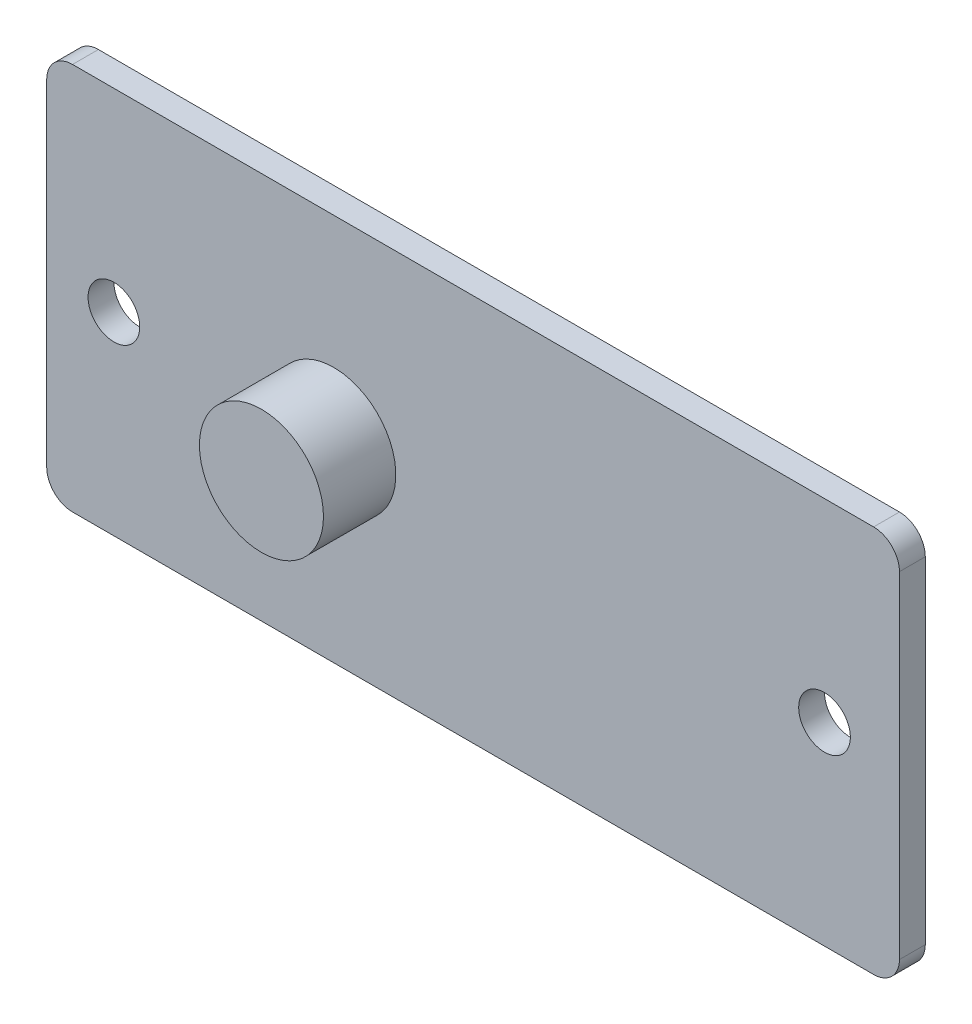
ISO-10303-21;
HEADER;
FILE_DESCRIPTION(('STEP AP214'),'2;1');
FILE_NAME('part.step','',(''),(''),'','','');
FILE_SCHEMA(('AUTOMOTIVE_DESIGN { 1 0 10303 214 1 1 1 1 }'));
ENDSEC;
DATA;
#1=APPLICATION_CONTEXT('core data for automotive mechanical design processes');
#2=APPLICATION_PROTOCOL_DEFINITION('international standard','automotive_design',2000,#1);
#3=PRODUCT_CONTEXT('',#1,'mechanical');
#4=PRODUCT('Part','Part','',(#3));
#5=PRODUCT_RELATED_PRODUCT_CATEGORY('part','',(#4));
#6=PRODUCT_DEFINITION_FORMATION('','',#4);
#7=PRODUCT_DEFINITION_CONTEXT('part definition',#1,'design');
#8=PRODUCT_DEFINITION('design','',#6,#7);
#9=PRODUCT_DEFINITION_SHAPE('','',#8);
#10=(LENGTH_UNIT() NAMED_UNIT(*) SI_UNIT(.MILLI.,.METRE.));
#11=(NAMED_UNIT(*) PLANE_ANGLE_UNIT() SI_UNIT($,.RADIAN.));
#12=(NAMED_UNIT(*) SI_UNIT($,.STERADIAN.) SOLID_ANGLE_UNIT());
#13=UNCERTAINTY_MEASURE_WITH_UNIT(LENGTH_MEASURE(1.E-05),#10,'distance_accuracy_value','');
#14=(GEOMETRIC_REPRESENTATION_CONTEXT(3) GLOBAL_UNCERTAINTY_ASSIGNED_CONTEXT((#13)) GLOBAL_UNIT_ASSIGNED_CONTEXT((#10,
#11,#12)) REPRESENTATION_CONTEXT('',''));
#15=CARTESIAN_POINT('',(0.,0.,0.));
#16=DIRECTION('',(0.,0.,1.));
#17=DIRECTION('',(1.,0.,0.));
#18=AXIS2_PLACEMENT_3D('',#15,#16,#17);
#19=CARTESIAN_POINT('',(15.5,6.5,1.));
#20=DIRECTION('',(0.,0.,-1.));
#21=DIRECTION('',(-1.,0.,0.));
#22=AXIS2_PLACEMENT_3D('',#19,#20,#21);
#23=PLANE('',#22);
#24=CARTESIAN_POINT('',(-5.39,0.,1.));
#25=DIRECTION('',(0.,0.,-1.));
#26=DIRECTION('',(-1.,0.,0.));
#27=AXIS2_PLACEMENT_3D('',#24,#25,#26);
#28=CIRCLE('',#27,2.4);
#29=CARTESIAN_POINT('',(-7.79,0.,1.));
#30=VERTEX_POINT('',#29);
#31=EDGE_CURVE('E11',#30,#30,#28,.F.);
#32=ORIENTED_EDGE('',*,*,#31,.F.);
#33=EDGE_LOOP('',(#32));
#34=FACE_BOUND('',#33,.T.);
#35=CARTESIAN_POINT('',(15.5,6.5,1.));
#36=DIRECTION('',(0.,0.,1.));
#37=DIRECTION('',(-1.,0.,0.));
#38=AXIS2_PLACEMENT_3D('',#35,#36,#37);
#39=CIRCLE('',#38,1.);
#40=CARTESIAN_POINT('',(16.5,6.49999999999999,1.));
#41=VERTEX_POINT('',#40);
#42=CARTESIAN_POINT('',(15.5,7.5,1.));
#43=VERTEX_POINT('',#42);
#44=EDGE_CURVE('E145',#41,#43,#39,.T.);
#45=ORIENTED_EDGE('',*,*,#44,.T.);
#46=DIRECTION('',(-1.,0.,0.));
#47=VECTOR('',#46,1.);
#48=CARTESIAN_POINT('',(-15.5,7.5,1.));
#49=LINE('',#48,#47);
#50=CARTESIAN_POINT('',(-15.5,7.5,1.));
#51=VERTEX_POINT('',#50);
#52=EDGE_CURVE('E93',#43,#51,#49,.T.);
#53=ORIENTED_EDGE('',*,*,#52,.T.);
#54=CARTESIAN_POINT('',(-15.5,6.5,1.));
#55=DIRECTION('',(0.,0.,1.));
#56=DIRECTION('',(1.,0.,0.));
#57=AXIS2_PLACEMENT_3D('',#54,#55,#56);
#58=CIRCLE('',#57,1.);
#59=CARTESIAN_POINT('',(-16.5,6.49999999999999,1.));
#60=VERTEX_POINT('',#59);
#61=EDGE_CURVE('E177',#51,#60,#58,.T.);
#62=ORIENTED_EDGE('',*,*,#61,.T.);
#63=DIRECTION('',(0.,-1.,0.));
#64=VECTOR('',#63,1.);
#65=CARTESIAN_POINT('',(-16.5,6.49999999999999,1.));
#66=LINE('',#65,#64);
#67=CARTESIAN_POINT('',(-16.5,-6.49999999999999,1.));
#68=VERTEX_POINT('',#67);
#69=EDGE_CURVE('E176',#60,#68,#66,.T.);
#70=ORIENTED_EDGE('',*,*,#69,.T.);
#71=CARTESIAN_POINT('',(-15.5,-6.5,1.));
#72=DIRECTION('',(0.,0.,1.));
#73=DIRECTION('',(1.,0.,0.));
#74=AXIS2_PLACEMENT_3D('',#71,#72,#73);
#75=CIRCLE('',#74,1.);
#76=CARTESIAN_POINT('',(-15.5,-7.5,1.));
#77=VERTEX_POINT('',#76);
#78=EDGE_CURVE('E112',#68,#77,#75,.T.);
#79=ORIENTED_EDGE('',*,*,#78,.T.);
#80=DIRECTION('',(1.,0.,0.));
#81=VECTOR('',#80,1.);
#82=CARTESIAN_POINT('',(-15.5,-7.5,1.));
#83=LINE('',#82,#81);
#84=CARTESIAN_POINT('',(15.5,-7.5,1.));
#85=VERTEX_POINT('',#84);
#86=EDGE_CURVE('E106',#77,#85,#83,.T.);
#87=ORIENTED_EDGE('',*,*,#86,.T.);
#88=CARTESIAN_POINT('',(15.5,-6.5,1.));
#89=DIRECTION('',(0.,0.,1.));
#90=DIRECTION('',(1.,0.,0.));
#91=AXIS2_PLACEMENT_3D('',#88,#89,#90);
#92=CIRCLE('',#91,1.);
#93=CARTESIAN_POINT('',(16.5,-6.5,1.));
#94=VERTEX_POINT('',#93);
#95=EDGE_CURVE('E110',#85,#94,#92,.T.);
#96=ORIENTED_EDGE('',*,*,#95,.T.);
#97=DIRECTION('',(0.,1.,0.));
#98=VECTOR('',#97,1.);
#99=CARTESIAN_POINT('',(16.5,6.49999999999999,1.));
#100=LINE('',#99,#98);
#101=EDGE_CURVE('E49',#94,#41,#100,.T.);
#102=ORIENTED_EDGE('',*,*,#101,.T.);
#103=EDGE_LOOP('',(#45,#53,#62,#70,#79,#87,#96,#102));
#104=FACE_BOUND('',#103,.T.);
#105=CARTESIAN_POINT('',(-13.9,0.,1.));
#106=DIRECTION('',(0.,0.,1.));
#107=DIRECTION('',(1.,0.,0.));
#108=AXIS2_PLACEMENT_3D('',#105,#106,#107);
#109=CIRCLE('',#108,1.);
#110=CARTESIAN_POINT('',(-12.9,0.,1.));
#111=VERTEX_POINT('',#110);
#112=EDGE_CURVE('E134',#111,#111,#109,.T.);
#113=ORIENTED_EDGE('',*,*,#112,.F.);
#114=EDGE_LOOP('',(#113));
#115=FACE_BOUND('',#114,.T.);
#116=CARTESIAN_POINT('',(13.6,0.,1.));
#117=DIRECTION('',(0.,0.,1.));
#118=DIRECTION('',(-1.,0.,0.));
#119=AXIS2_PLACEMENT_3D('',#116,#117,#118);
#120=CIRCLE('',#119,1.);
#121=CARTESIAN_POINT('',(12.6,0.,1.));
#122=VERTEX_POINT('',#121);
#123=EDGE_CURVE('E186',#122,#122,#120,.T.);
#124=ORIENTED_EDGE('',*,*,#123,.F.);
#125=EDGE_LOOP('',(#124));
#126=FACE_BOUND('',#125,.T.);
#127=ADVANCED_FACE('F32',(#34,#104,#115,#126),#23,.F.);
#128=CARTESIAN_POINT('',(15.5,6.5,0.));
#129=DIRECTION('',(0.,0.,-1.));
#130=DIRECTION('',(-1.,0.,0.));
#131=AXIS2_PLACEMENT_3D('',#128,#129,#130);
#132=PLANE('',#131);
#133=CARTESIAN_POINT('',(-13.9,0.,0.));
#134=DIRECTION('',(0.,0.,1.));
#135=DIRECTION('',(1.,0.,0.));
#136=AXIS2_PLACEMENT_3D('',#133,#134,#135);
#137=CIRCLE('',#136,1.);
#138=CARTESIAN_POINT('',(-12.9,0.,0.));
#139=VERTEX_POINT('',#138);
#140=EDGE_CURVE('E183',#139,#139,#137,.T.);
#141=ORIENTED_EDGE('',*,*,#140,.T.);
#142=EDGE_LOOP('',(#141));
#143=FACE_BOUND('',#142,.T.);
#144=CARTESIAN_POINT('',(15.5,6.5,0.));
#145=DIRECTION('',(0.,0.,1.));
#146=DIRECTION('',(-1.,0.,0.));
#147=AXIS2_PLACEMENT_3D('',#144,#145,#146);
#148=CIRCLE('',#147,1.);
#149=CARTESIAN_POINT('',(16.5,6.49999999999999,0.));
#150=VERTEX_POINT('',#149);
#151=CARTESIAN_POINT('',(15.5,7.5,0.));
#152=VERTEX_POINT('',#151);
#153=EDGE_CURVE('E130',#150,#152,#148,.T.);
#154=ORIENTED_EDGE('',*,*,#153,.F.);
#155=DIRECTION('',(0.,1.,0.));
#156=VECTOR('',#155,1.);
#157=CARTESIAN_POINT('',(16.5,6.49999999999999,0.));
#158=LINE('',#157,#156);
#159=CARTESIAN_POINT('',(16.5,-6.5,0.));
#160=VERTEX_POINT('',#159);
#161=EDGE_CURVE('E84',#160,#150,#158,.T.);
#162=ORIENTED_EDGE('',*,*,#161,.F.);
#163=CARTESIAN_POINT('',(15.5,-6.5,0.));
#164=DIRECTION('',(0.,0.,1.));
#165=DIRECTION('',(1.,0.,0.));
#166=AXIS2_PLACEMENT_3D('',#163,#164,#165);
#167=CIRCLE('',#166,1.);
#168=CARTESIAN_POINT('',(15.5,-7.5,0.));
#169=VERTEX_POINT('',#168);
#170=EDGE_CURVE('E78',#169,#160,#167,.T.);
#171=ORIENTED_EDGE('',*,*,#170,.F.);
#172=DIRECTION('',(1.,0.,0.));
#173=VECTOR('',#172,1.);
#174=CARTESIAN_POINT('',(-15.5,-7.5,0.));
#175=LINE('',#174,#173);
#176=CARTESIAN_POINT('',(-15.5,-7.5,0.));
#177=VERTEX_POINT('',#176);
#178=EDGE_CURVE('E120',#177,#169,#175,.T.);
#179=ORIENTED_EDGE('',*,*,#178,.F.);
#180=CARTESIAN_POINT('',(-15.5,-6.5,0.));
#181=DIRECTION('',(0.,0.,1.));
#182=DIRECTION('',(1.,0.,0.));
#183=AXIS2_PLACEMENT_3D('',#180,#181,#182);
#184=CIRCLE('',#183,1.);
#185=CARTESIAN_POINT('',(-16.5,-6.49999999999999,0.));
#186=VERTEX_POINT('',#185);
#187=EDGE_CURVE('E140',#186,#177,#184,.T.);
#188=ORIENTED_EDGE('',*,*,#187,.F.);
#189=DIRECTION('',(0.,-1.,0.));
#190=VECTOR('',#189,1.);
#191=CARTESIAN_POINT('',(-16.5,6.49999999999999,0.));
#192=LINE('',#191,#190);
#193=CARTESIAN_POINT('',(-16.5,6.49999999999999,0.));
#194=VERTEX_POINT('',#193);
#195=EDGE_CURVE('E138',#194,#186,#192,.T.);
#196=ORIENTED_EDGE('',*,*,#195,.F.);
#197=CARTESIAN_POINT('',(-15.5,6.5,0.));
#198=DIRECTION('',(0.,0.,1.));
#199=DIRECTION('',(1.,0.,0.));
#200=AXIS2_PLACEMENT_3D('',#197,#198,#199);
#201=CIRCLE('',#200,1.);
#202=CARTESIAN_POINT('',(-15.5,7.5,0.));
#203=VERTEX_POINT('',#202);
#204=EDGE_CURVE('E136',#203,#194,#201,.T.);
#205=ORIENTED_EDGE('',*,*,#204,.F.);
#206=DIRECTION('',(-1.,0.,0.));
#207=VECTOR('',#206,1.);
#208=CARTESIAN_POINT('',(-15.5,7.5,0.));
#209=LINE('',#208,#207);
#210=EDGE_CURVE('E133',#152,#203,#209,.T.);
#211=ORIENTED_EDGE('',*,*,#210,.F.);
#212=EDGE_LOOP('',(#154,#162,#171,#179,#188,#196,#205,#211));
#213=FACE_BOUND('',#212,.T.);
#214=CARTESIAN_POINT('',(13.6,0.,0.));
#215=DIRECTION('',(0.,0.,1.));
#216=DIRECTION('',(-1.,0.,0.));
#217=AXIS2_PLACEMENT_3D('',#214,#215,#216);
#218=CIRCLE('',#217,1.);
#219=CARTESIAN_POINT('',(12.6,0.,0.));
#220=VERTEX_POINT('',#219);
#221=EDGE_CURVE('E189',#220,#220,#218,.T.);
#222=ORIENTED_EDGE('',*,*,#221,.T.);
#223=EDGE_LOOP('',(#222));
#224=FACE_BOUND('',#223,.T.);
#225=ADVANCED_FACE('F163',(#143,#213,#224),#132,.T.);
#226=CARTESIAN_POINT('',(15.5,6.5,1.));
#227=DIRECTION('',(0.,0.,-1.));
#228=DIRECTION('',(-1.,0.,0.));
#229=AXIS2_PLACEMENT_3D('',#226,#227,#228);
#230=CYLINDRICAL_SURFACE('',#229,1.);
#231=ORIENTED_EDGE('',*,*,#153,.T.);
#232=DIRECTION('',(0.,0.,-1.));
#233=VECTOR('',#232,1.);
#234=CARTESIAN_POINT('',(15.5,7.5,1.));
#235=LINE('',#234,#233);
#236=EDGE_CURVE('E41',#43,#152,#235,.T.);
#237=ORIENTED_EDGE('',*,*,#236,.F.);
#238=ORIENTED_EDGE('',*,*,#44,.F.);
#239=DIRECTION('',(0.,0.,-1.));
#240=VECTOR('',#239,1.);
#241=CARTESIAN_POINT('',(16.5,6.49999999999999,1.));
#242=LINE('',#241,#240);
#243=EDGE_CURVE('E126',#41,#150,#242,.T.);
#244=ORIENTED_EDGE('',*,*,#243,.T.);
#245=EDGE_LOOP('',(#231,#237,#238,#244));
#246=FACE_BOUND('',#245,.T.);
#247=ADVANCED_FACE('F34',(#246),#230,.T.);
#248=CARTESIAN_POINT('',(-15.5,7.5,1.));
#249=DIRECTION('',(0.,-1.,0.));
#250=DIRECTION('',(0.,0.,-1.));
#251=AXIS2_PLACEMENT_3D('',#248,#249,#250);
#252=PLANE('',#251);
#253=ORIENTED_EDGE('',*,*,#210,.T.);
#254=DIRECTION('',(0.,0.,-1.));
#255=VECTOR('',#254,1.);
#256=CARTESIAN_POINT('',(-15.5,7.5,1.));
#257=LINE('',#256,#255);
#258=EDGE_CURVE('E155',#51,#203,#257,.T.);
#259=ORIENTED_EDGE('',*,*,#258,.F.);
#260=ORIENTED_EDGE('',*,*,#52,.F.);
#261=ORIENTED_EDGE('',*,*,#236,.T.);
#262=EDGE_LOOP('',(#253,#259,#260,#261));
#263=FACE_BOUND('',#262,.T.);
#264=ADVANCED_FACE('F158',(#263),#252,.F.);
#265=CARTESIAN_POINT('',(-15.5,6.5,1.));
#266=DIRECTION('',(0.,0.,-1.));
#267=DIRECTION('',(-1.,0.,0.));
#268=AXIS2_PLACEMENT_3D('',#265,#266,#267);
#269=CYLINDRICAL_SURFACE('',#268,1.);
#270=ORIENTED_EDGE('',*,*,#204,.T.);
#271=DIRECTION('',(0.,0.,-1.));
#272=VECTOR('',#271,1.);
#273=CARTESIAN_POINT('',(-16.5,6.49999999999999,1.));
#274=LINE('',#273,#272);
#275=EDGE_CURVE('E152',#60,#194,#274,.T.);
#276=ORIENTED_EDGE('',*,*,#275,.F.);
#277=ORIENTED_EDGE('',*,*,#61,.F.);
#278=ORIENTED_EDGE('',*,*,#258,.T.);
#279=EDGE_LOOP('',(#270,#276,#277,#278));
#280=FACE_BOUND('',#279,.T.);
#281=ADVANCED_FACE('F170',(#280),#269,.T.);
#282=CARTESIAN_POINT('',(-16.5,6.49999999999999,1.));
#283=DIRECTION('',(1.,0.,0.));
#284=DIRECTION('',(0.,1.,0.));
#285=AXIS2_PLACEMENT_3D('',#282,#283,#284);
#286=PLANE('',#285);
#287=ORIENTED_EDGE('',*,*,#195,.T.);
#288=DIRECTION('',(0.,0.,-1.));
#289=VECTOR('',#288,1.);
#290=CARTESIAN_POINT('',(-16.5,-6.49999999999999,1.));
#291=LINE('',#290,#289);
#292=EDGE_CURVE('E149',#68,#186,#291,.T.);
#293=ORIENTED_EDGE('',*,*,#292,.F.);
#294=ORIENTED_EDGE('',*,*,#69,.F.);
#295=ORIENTED_EDGE('',*,*,#275,.T.);
#296=EDGE_LOOP('',(#287,#293,#294,#295));
#297=FACE_BOUND('',#296,.T.);
#298=ADVANCED_FACE('F174',(#297),#286,.F.);
#299=CARTESIAN_POINT('',(-15.5,-6.5,1.));
#300=DIRECTION('',(0.,0.,-1.));
#301=DIRECTION('',(-1.,0.,0.));
#302=AXIS2_PLACEMENT_3D('',#299,#300,#301);
#303=CYLINDRICAL_SURFACE('',#302,1.);
#304=ORIENTED_EDGE('',*,*,#187,.T.);
#305=DIRECTION('',(0.,0.,-1.));
#306=VECTOR('',#305,1.);
#307=CARTESIAN_POINT('',(-15.5,-7.5,1.));
#308=LINE('',#307,#306);
#309=EDGE_CURVE('E121',#77,#177,#308,.T.);
#310=ORIENTED_EDGE('',*,*,#309,.F.);
#311=ORIENTED_EDGE('',*,*,#78,.F.);
#312=ORIENTED_EDGE('',*,*,#292,.T.);
#313=EDGE_LOOP('',(#304,#310,#311,#312));
#314=FACE_BOUND('',#313,.T.);
#315=ADVANCED_FACE('F225',(#314),#303,.T.);
#316=CARTESIAN_POINT('',(-15.5,-7.5,1.));
#317=DIRECTION('',(0.,1.,0.));
#318=DIRECTION('',(0.,0.,1.));
#319=AXIS2_PLACEMENT_3D('',#316,#317,#318);
#320=PLANE('',#319);
#321=ORIENTED_EDGE('',*,*,#178,.T.);
#322=DIRECTION('',(0.,0.,-1.));
#323=VECTOR('',#322,1.);
#324=CARTESIAN_POINT('',(15.5,-7.5,1.));
#325=LINE('',#324,#323);
#326=EDGE_CURVE('E117',#85,#169,#325,.T.);
#327=ORIENTED_EDGE('',*,*,#326,.F.);
#328=ORIENTED_EDGE('',*,*,#86,.F.);
#329=ORIENTED_EDGE('',*,*,#309,.T.);
#330=EDGE_LOOP('',(#321,#327,#328,#329));
#331=FACE_BOUND('',#330,.T.);
#332=ADVANCED_FACE('F118',(#331),#320,.F.);
#333=CARTESIAN_POINT('',(15.5,-6.5,1.));
#334=DIRECTION('',(0.,0.,-1.));
#335=DIRECTION('',(-1.,0.,0.));
#336=AXIS2_PLACEMENT_3D('',#333,#334,#335);
#337=CYLINDRICAL_SURFACE('',#336,1.);
#338=ORIENTED_EDGE('',*,*,#170,.T.);
#339=DIRECTION('',(0.,0.,-1.));
#340=VECTOR('',#339,1.);
#341=CARTESIAN_POINT('',(16.5,-6.5,1.));
#342=LINE('',#341,#340);
#343=EDGE_CURVE('E122',#94,#160,#342,.T.);
#344=ORIENTED_EDGE('',*,*,#343,.F.);
#345=ORIENTED_EDGE('',*,*,#95,.F.);
#346=ORIENTED_EDGE('',*,*,#326,.T.);
#347=EDGE_LOOP('',(#338,#344,#345,#346));
#348=FACE_BOUND('',#347,.T.);
#349=ADVANCED_FACE('F124',(#348),#337,.T.);
#350=CARTESIAN_POINT('',(16.5,6.49999999999999,1.));
#351=DIRECTION('',(-1.,0.,0.));
#352=DIRECTION('',(0.,-1.,0.));
#353=AXIS2_PLACEMENT_3D('',#350,#351,#352);
#354=PLANE('',#353);
#355=ORIENTED_EDGE('',*,*,#161,.T.);
#356=ORIENTED_EDGE('',*,*,#243,.F.);
#357=ORIENTED_EDGE('',*,*,#101,.F.);
#358=ORIENTED_EDGE('',*,*,#343,.T.);
#359=EDGE_LOOP('',(#355,#356,#357,#358));
#360=FACE_BOUND('',#359,.T.);
#361=ADVANCED_FACE('F218',(#360),#354,.F.);
#362=CARTESIAN_POINT('',(-13.9,0.,1.));
#363=DIRECTION('',(0.,0.,-1.));
#364=DIRECTION('',(-1.,0.,0.));
#365=AXIS2_PLACEMENT_3D('',#362,#363,#364);
#366=CYLINDRICAL_SURFACE('',#365,1.);
#367=ORIENTED_EDGE('',*,*,#112,.T.);
#368=EDGE_LOOP('',(#367));
#369=FACE_BOUND('',#368,.T.);
#370=ORIENTED_EDGE('',*,*,#140,.F.);
#371=EDGE_LOOP('',(#370));
#372=FACE_BOUND('',#371,.T.);
#373=ADVANCED_FACE('F215',(#369,#372),#366,.F.);
#374=CARTESIAN_POINT('',(13.6,0.,1.));
#375=DIRECTION('',(0.,0.,-1.));
#376=DIRECTION('',(-1.,0.,0.));
#377=AXIS2_PLACEMENT_3D('',#374,#375,#376);
#378=CYLINDRICAL_SURFACE('',#377,1.);
#379=ORIENTED_EDGE('',*,*,#123,.T.);
#380=EDGE_LOOP('',(#379));
#381=FACE_BOUND('',#380,.T.);
#382=ORIENTED_EDGE('',*,*,#221,.F.);
#383=EDGE_LOOP('',(#382));
#384=FACE_BOUND('',#383,.T.);
#385=ADVANCED_FACE('F203',(#381,#384),#378,.F.);
#386=CARTESIAN_POINT('',(-5.39,0.,3.8));
#387=DIRECTION('',(0.,0.,-1.));
#388=DIRECTION('',(-1.,0.,0.));
#389=AXIS2_PLACEMENT_3D('',#386,#387,#388);
#390=CYLINDRICAL_SURFACE('',#389,2.4);
#391=CARTESIAN_POINT('',(-5.39,0.,3.8));
#392=DIRECTION('',(0.,0.,1.));
#393=DIRECTION('',(1.,0.,0.));
#394=AXIS2_PLACEMENT_3D('',#391,#392,#393);
#395=CIRCLE('',#394,2.4);
#396=CARTESIAN_POINT('',(-2.99,0.,3.8));
#397=VERTEX_POINT('',#396);
#398=EDGE_CURVE('E192',#397,#397,#395,.T.);
#399=ORIENTED_EDGE('',*,*,#398,.F.);
#400=EDGE_LOOP('',(#399));
#401=FACE_BOUND('',#400,.T.);
#402=ORIENTED_EDGE('',*,*,#31,.T.);
#403=EDGE_LOOP('',(#402));
#404=FACE_BOUND('',#403,.T.);
#405=ADVANCED_FACE('F200',(#401,#404),#390,.T.);
#406=CARTESIAN_POINT('',(-5.39,0.,3.8));
#407=DIRECTION('',(0.,0.,1.));
#408=DIRECTION('',(1.,0.,0.));
#409=AXIS2_PLACEMENT_3D('',#406,#407,#408);
#410=PLANE('',#409);
#411=ORIENTED_EDGE('',*,*,#398,.T.);
#412=EDGE_LOOP('',(#411));
#413=FACE_BOUND('',#412,.T.);
#414=ADVANCED_FACE('F198',(#413),#410,.T.);
#415=CLOSED_SHELL('',(#127,#225,#247,#264,#281,#298,#315,#332,#349,#361,#373,#385,#405,#414));
#416=MANIFOLD_SOLID_BREP('B2',#415);
#417=ADVANCED_BREP_SHAPE_REPRESENTATION('',(#18,#416),#14);
#418=SHAPE_DEFINITION_REPRESENTATION(#9,#417);
ENDSEC;
END-ISO-10303-21;
